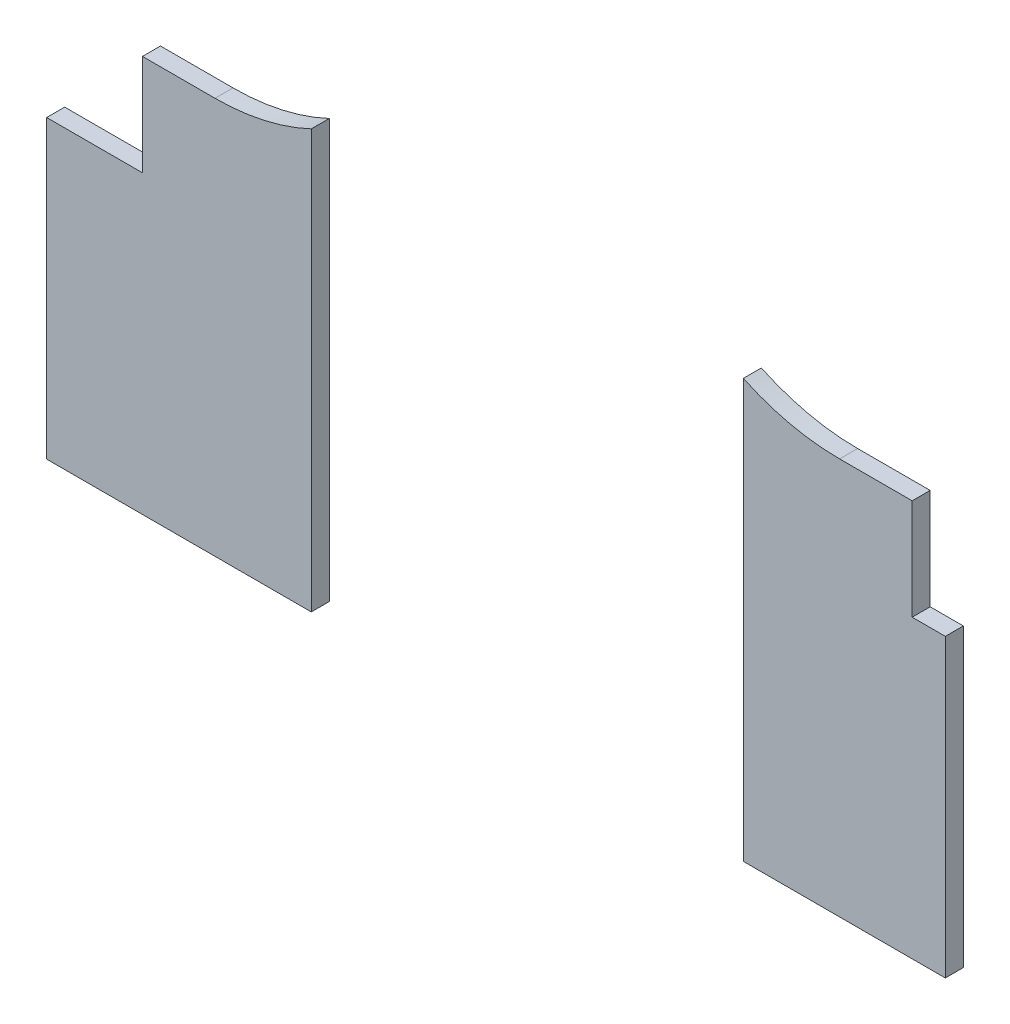
ISO-10303-21;
HEADER;
FILE_DESCRIPTION(('STEP AP214'),'2;1');
FILE_NAME('part.step','',(''),(''),'','','');
FILE_SCHEMA(('AUTOMOTIVE_DESIGN { 1 0 10303 214 1 1 1 1 }'));
ENDSEC;
DATA;
#1=APPLICATION_CONTEXT('core data for automotive mechanical design processes');
#2=APPLICATION_PROTOCOL_DEFINITION('international standard','automotive_design',2000,#1);
#3=PRODUCT_CONTEXT('',#1,'mechanical');
#4=PRODUCT('Part','Part','',(#3));
#5=PRODUCT_RELATED_PRODUCT_CATEGORY('part','',(#4));
#6=PRODUCT_DEFINITION_FORMATION('','',#4);
#7=PRODUCT_DEFINITION_CONTEXT('part definition',#1,'design');
#8=PRODUCT_DEFINITION('design','',#6,#7);
#9=PRODUCT_DEFINITION_SHAPE('','',#8);
#10=(LENGTH_UNIT() NAMED_UNIT(*) SI_UNIT(.MILLI.,.METRE.));
#11=(NAMED_UNIT(*) PLANE_ANGLE_UNIT() SI_UNIT($,.RADIAN.));
#12=(NAMED_UNIT(*) SI_UNIT($,.STERADIAN.) SOLID_ANGLE_UNIT());
#13=UNCERTAINTY_MEASURE_WITH_UNIT(LENGTH_MEASURE(1.E-05),#10,'distance_accuracy_value','');
#14=(GEOMETRIC_REPRESENTATION_CONTEXT(3) GLOBAL_UNCERTAINTY_ASSIGNED_CONTEXT((#13)) GLOBAL_UNIT_ASSIGNED_CONTEXT((#10,
#11,#12)) REPRESENTATION_CONTEXT('',''));
#15=CARTESIAN_POINT('',(0.,0.,0.));
#16=DIRECTION('',(0.,0.,1.));
#17=DIRECTION('',(1.,0.,0.));
#18=AXIS2_PLACEMENT_3D('',#15,#16,#17);
#19=CARTESIAN_POINT('',(0.,0.,5.));
#20=DIRECTION('',(0.,0.,1.));
#21=DIRECTION('',(1.,0.,0.));
#22=AXIS2_PLACEMENT_3D('',#19,#20,#21);
#23=PLANE('',#22);
#24=DIRECTION('',(0.,-1.,0.));
#25=VECTOR('',#24,1.);
#26=CARTESIAN_POINT('',(73.5,-195.561220372056,5.));
#27=LINE('',#26,#25);
#28=CARTESIAN_POINT('',(73.5,-79.3612478970206,5.));
#29=VERTEX_POINT('',#28);
#30=CARTESIAN_POINT('',(73.5,-195.561220372056,5.));
#31=VERTEX_POINT('',#30);
#32=EDGE_CURVE('E12',#29,#31,#27,.T.);
#33=ORIENTED_EDGE('',*,*,#32,.F.);
#34=CARTESIAN_POINT('',(46.7503925080926,-22.8748911457759,5.));
#35=DIRECTION('',(0.,0.,1.));
#36=DIRECTION('',(1.,0.,0.));
#37=AXIS2_PLACEMENT_3D('',#34,#35,#36);
#38=CIRCLE('',#37,62.5);
#39=CARTESIAN_POINT('',(46.7503925080926,-85.3748911457759,5.));
#40=VERTEX_POINT('',#39);
#41=EDGE_CURVE('E129',#40,#29,#38,.T.);
#42=ORIENTED_EDGE('',*,*,#41,.F.);
#43=DIRECTION('',(1.,0.,0.));
#44=VECTOR('',#43,1.);
#45=CARTESIAN_POINT('',(26.6043383580258,-85.3748911457759,5.));
#46=LINE('',#45,#44);
#47=CARTESIAN_POINT('',(26.6043383580258,-85.3748911457759,5.));
#48=VERTEX_POINT('',#47);
#49=EDGE_CURVE('E147',#48,#40,#46,.T.);
#50=ORIENTED_EDGE('',*,*,#49,.F.);
#51=DIRECTION('',(0.,1.,0.));
#52=VECTOR('',#51,1.);
#53=CARTESIAN_POINT('',(26.6043383580258,-113.374891145776,5.));
#54=LINE('',#53,#52);
#55=CARTESIAN_POINT('',(26.6043383580258,-113.374891145776,5.));
#56=VERTEX_POINT('',#55);
#57=EDGE_CURVE('E145',#56,#48,#54,.T.);
#58=ORIENTED_EDGE('',*,*,#57,.F.);
#59=DIRECTION('',(1.,0.,0.));
#60=VECTOR('',#59,1.);
#61=CARTESIAN_POINT('',(0.,-113.374891145776,5.));
#62=LINE('',#61,#60);
#63=CARTESIAN_POINT('',(0.,-113.374891145776,5.));
#64=VERTEX_POINT('',#63);
#65=EDGE_CURVE('E132',#64,#56,#62,.T.);
#66=ORIENTED_EDGE('',*,*,#65,.F.);
#67=DIRECTION('',(0.,-1.,0.));
#68=VECTOR('',#67,1.);
#69=CARTESIAN_POINT('',(0.,0.,5.));
#70=LINE('',#69,#68);
#71=CARTESIAN_POINT('',(0.,-195.561220372056,5.));
#72=VERTEX_POINT('',#71);
#73=EDGE_CURVE('E128',#64,#72,#70,.T.);
#74=ORIENTED_EDGE('',*,*,#73,.T.);
#75=DIRECTION('',(-1.,0.,0.));
#76=VECTOR('',#75,1.);
#77=CARTESIAN_POINT('',(0.,-195.561220372056,5.));
#78=LINE('',#77,#76);
#79=EDGE_CURVE('E50',#31,#72,#78,.T.);
#80=ORIENTED_EDGE('',*,*,#79,.F.);
#81=EDGE_LOOP('',(#33,#42,#50,#58,#66,#74,#80));
#82=FACE_BOUND('',#81,.T.);
#83=ADVANCED_FACE('F47',(#82),#23,.T.);
#84=CARTESIAN_POINT('',(0.,0.,0.));
#85=DIRECTION('',(0.,0.,1.));
#86=DIRECTION('',(1.,0.,0.));
#87=AXIS2_PLACEMENT_3D('',#84,#85,#86);
#88=PLANE('',#87);
#89=CARTESIAN_POINT('',(46.7503925080926,-22.8748911457759,0.));
#90=DIRECTION('',(0.,0.,1.));
#91=DIRECTION('',(1.,0.,0.));
#92=AXIS2_PLACEMENT_3D('',#89,#90,#91);
#93=CIRCLE('',#92,62.5);
#94=CARTESIAN_POINT('',(46.7503925080926,-85.3748911457759,0.));
#95=VERTEX_POINT('',#94);
#96=CARTESIAN_POINT('',(73.5,-79.3612478970206,0.));
#97=VERTEX_POINT('',#96);
#98=EDGE_CURVE('E133',#95,#97,#93,.T.);
#99=ORIENTED_EDGE('',*,*,#98,.T.);
#100=DIRECTION('',(0.,-1.,0.));
#101=VECTOR('',#100,1.);
#102=CARTESIAN_POINT('',(73.5,-195.561220372056,0.));
#103=LINE('',#102,#101);
#104=CARTESIAN_POINT('',(73.5,-195.561220372056,0.));
#105=VERTEX_POINT('',#104);
#106=EDGE_CURVE('E136',#97,#105,#103,.T.);
#107=ORIENTED_EDGE('',*,*,#106,.T.);
#108=DIRECTION('',(-1.,0.,0.));
#109=VECTOR('',#108,1.);
#110=CARTESIAN_POINT('',(0.,-195.561220372056,0.));
#111=LINE('',#110,#109);
#112=CARTESIAN_POINT('',(0.,-195.561220372056,0.));
#113=VERTEX_POINT('',#112);
#114=EDGE_CURVE('E112',#105,#113,#111,.T.);
#115=ORIENTED_EDGE('',*,*,#114,.T.);
#116=DIRECTION('',(0.,-1.,0.));
#117=VECTOR('',#116,1.);
#118=CARTESIAN_POINT('',(0.,0.,0.));
#119=LINE('',#118,#117);
#120=CARTESIAN_POINT('',(0.,-113.374891145776,0.));
#121=VERTEX_POINT('',#120);
#122=EDGE_CURVE('E124',#121,#113,#119,.T.);
#123=ORIENTED_EDGE('',*,*,#122,.F.);
#124=DIRECTION('',(1.,0.,0.));
#125=VECTOR('',#124,1.);
#126=CARTESIAN_POINT('',(0.,-113.374891145776,0.));
#127=LINE('',#126,#125);
#128=CARTESIAN_POINT('',(26.6043383580258,-113.374891145776,0.));
#129=VERTEX_POINT('',#128);
#130=EDGE_CURVE('E161',#121,#129,#127,.T.);
#131=ORIENTED_EDGE('',*,*,#130,.T.);
#132=DIRECTION('',(0.,1.,0.));
#133=VECTOR('',#132,1.);
#134=CARTESIAN_POINT('',(26.6043383580258,-113.374891145776,0.));
#135=LINE('',#134,#133);
#136=CARTESIAN_POINT('',(26.6043383580258,-85.3748911457759,0.));
#137=VERTEX_POINT('',#136);
#138=EDGE_CURVE('E158',#129,#137,#135,.T.);
#139=ORIENTED_EDGE('',*,*,#138,.T.);
#140=DIRECTION('',(1.,0.,0.));
#141=VECTOR('',#140,1.);
#142=CARTESIAN_POINT('',(26.6043383580258,-85.3748911457759,0.));
#143=LINE('',#142,#141);
#144=EDGE_CURVE('E155',#137,#95,#143,.T.);
#145=ORIENTED_EDGE('',*,*,#144,.T.);
#146=EDGE_LOOP('',(#99,#107,#115,#123,#131,#139,#145));
#147=FACE_BOUND('',#146,.T.);
#148=ADVANCED_FACE('F165',(#147),#88,.F.);
#149=CARTESIAN_POINT('',(0.,-195.561220372056,0.));
#150=DIRECTION('',(0.,1.,0.));
#151=DIRECTION('',(0.,0.,1.));
#152=AXIS2_PLACEMENT_3D('',#149,#150,#151);
#153=PLANE('',#152);
#154=ORIENTED_EDGE('',*,*,#114,.F.);
#155=DIRECTION('',(0.,0.,1.));
#156=VECTOR('',#155,1.);
#157=CARTESIAN_POINT('',(73.5,-195.561220372056,0.));
#158=LINE('',#157,#156);
#159=EDGE_CURVE('E121',#105,#31,#158,.T.);
#160=ORIENTED_EDGE('',*,*,#159,.T.);
#161=ORIENTED_EDGE('',*,*,#79,.T.);
#162=DIRECTION('',(0.,0.,1.));
#163=VECTOR('',#162,1.);
#164=CARTESIAN_POINT('',(0.,-195.561220372056,0.));
#165=LINE('',#164,#163);
#166=EDGE_CURVE('E119',#113,#72,#165,.T.);
#167=ORIENTED_EDGE('',*,*,#166,.F.);
#168=EDGE_LOOP('',(#154,#160,#161,#167));
#169=FACE_BOUND('',#168,.T.);
#170=ADVANCED_FACE('F118',(#169),#153,.F.);
#171=CARTESIAN_POINT('',(0.,0.,5.));
#172=DIRECTION('',(1.,0.,0.));
#173=DIRECTION('',(0.,1.,0.));
#174=AXIS2_PLACEMENT_3D('',#171,#172,#173);
#175=PLANE('',#174);
#176=ORIENTED_EDGE('',*,*,#73,.F.);
#177=DIRECTION('',(0.,0.,1.));
#178=VECTOR('',#177,1.);
#179=CARTESIAN_POINT('',(0.,-113.374891145776,0.));
#180=LINE('',#179,#178);
#181=EDGE_CURVE('E56',#121,#64,#180,.T.);
#182=ORIENTED_EDGE('',*,*,#181,.F.);
#183=ORIENTED_EDGE('',*,*,#122,.T.);
#184=ORIENTED_EDGE('',*,*,#166,.T.);
#185=EDGE_LOOP('',(#176,#182,#183,#184));
#186=FACE_BOUND('',#185,.T.);
#187=ADVANCED_FACE('F127',(#186),#175,.F.);
#188=CARTESIAN_POINT('',(46.7503925080926,-22.8748911457759,0.));
#189=DIRECTION('',(0.,0.,1.));
#190=DIRECTION('',(1.,0.,0.));
#191=AXIS2_PLACEMENT_3D('',#188,#189,#190);
#192=CYLINDRICAL_SURFACE('',#191,62.5);
#193=ORIENTED_EDGE('',*,*,#41,.T.);
#194=DIRECTION('',(0.,0.,1.));
#195=VECTOR('',#194,1.);
#196=CARTESIAN_POINT('',(73.5,-79.3612478970206,0.));
#197=LINE('',#196,#195);
#198=EDGE_CURVE('E64',#29,#97,#197,.F.);
#199=ORIENTED_EDGE('',*,*,#198,.T.);
#200=ORIENTED_EDGE('',*,*,#98,.F.);
#201=DIRECTION('',(0.,0.,1.));
#202=VECTOR('',#201,1.);
#203=CARTESIAN_POINT('',(46.7503925080926,-85.3748911457759,0.));
#204=LINE('',#203,#202);
#205=EDGE_CURVE('E148',#95,#40,#204,.T.);
#206=ORIENTED_EDGE('',*,*,#205,.T.);
#207=EDGE_LOOP('',(#193,#199,#200,#206));
#208=FACE_BOUND('',#207,.T.);
#209=ADVANCED_FACE('F169',(#208),#192,.F.);
#210=CARTESIAN_POINT('',(26.6043383580258,-85.3748911457759,0.));
#211=DIRECTION('',(0.,-1.,0.));
#212=DIRECTION('',(1.,0.,0.));
#213=AXIS2_PLACEMENT_3D('',#210,#211,#212);
#214=PLANE('',#213);
#215=ORIENTED_EDGE('',*,*,#49,.T.);
#216=ORIENTED_EDGE('',*,*,#205,.F.);
#217=ORIENTED_EDGE('',*,*,#144,.F.);
#218=DIRECTION('',(0.,0.,1.));
#219=VECTOR('',#218,1.);
#220=CARTESIAN_POINT('',(26.6043383580258,-85.3748911457759,0.));
#221=LINE('',#220,#219);
#222=EDGE_CURVE('E98',#137,#48,#221,.T.);
#223=ORIENTED_EDGE('',*,*,#222,.T.);
#224=EDGE_LOOP('',(#215,#216,#217,#223));
#225=FACE_BOUND('',#224,.T.);
#226=ADVANCED_FACE('F172',(#225),#214,.F.);
#227=CARTESIAN_POINT('',(26.6043383580258,-113.374891145776,0.));
#228=DIRECTION('',(1.,0.,0.));
#229=DIRECTION('',(0.,0.,-1.));
#230=AXIS2_PLACEMENT_3D('',#227,#228,#229);
#231=PLANE('',#230);
#232=ORIENTED_EDGE('',*,*,#57,.T.);
#233=ORIENTED_EDGE('',*,*,#222,.F.);
#234=ORIENTED_EDGE('',*,*,#138,.F.);
#235=DIRECTION('',(0.,0.,1.));
#236=VECTOR('',#235,1.);
#237=CARTESIAN_POINT('',(26.6043383580258,-113.374891145776,0.));
#238=LINE('',#237,#236);
#239=EDGE_CURVE('E142',#129,#56,#238,.T.);
#240=ORIENTED_EDGE('',*,*,#239,.T.);
#241=EDGE_LOOP('',(#232,#233,#234,#240));
#242=FACE_BOUND('',#241,.T.);
#243=ADVANCED_FACE('F174',(#242),#231,.F.);
#244=CARTESIAN_POINT('',(0.,-113.374891145776,0.));
#245=DIRECTION('',(0.,-1.,0.));
#246=DIRECTION('',(0.,0.,-1.));
#247=AXIS2_PLACEMENT_3D('',#244,#245,#246);
#248=PLANE('',#247);
#249=ORIENTED_EDGE('',*,*,#65,.T.);
#250=ORIENTED_EDGE('',*,*,#239,.F.);
#251=ORIENTED_EDGE('',*,*,#130,.F.);
#252=ORIENTED_EDGE('',*,*,#181,.T.);
#253=EDGE_LOOP('',(#249,#250,#251,#252));
#254=FACE_BOUND('',#253,.T.);
#255=ADVANCED_FACE('F175',(#254),#248,.F.);
#256=CARTESIAN_POINT('',(73.5,-195.561220372056,0.));
#257=DIRECTION('',(-1.,0.,0.));
#258=DIRECTION('',(0.,-1.,0.));
#259=AXIS2_PLACEMENT_3D('',#256,#257,#258);
#260=PLANE('',#259);
#261=ORIENTED_EDGE('',*,*,#32,.T.);
#262=ORIENTED_EDGE('',*,*,#159,.F.);
#263=ORIENTED_EDGE('',*,*,#106,.F.);
#264=ORIENTED_EDGE('',*,*,#198,.F.);
#265=EDGE_LOOP('',(#261,#262,#263,#264));
#266=FACE_BOUND('',#265,.T.);
#267=ADVANCED_FACE('F167',(#266),#260,.F.);
#268=CLOSED_SHELL('',(#83,#148,#170,#187,#209,#226,#243,#255,#267));
#269=MANIFOLD_SOLID_BREP('B2',#268);
#270=CARTESIAN_POINT('',(249.6,-113.374891145776,0.));
#271=DIRECTION('',(0.,-1.,0.));
#272=DIRECTION('',(0.,0.,-1.));
#273=AXIS2_PLACEMENT_3D('',#270,#271,#272);
#274=PLANE('',#273);
#275=DIRECTION('',(1.,0.,0.));
#276=VECTOR('',#275,1.);
#277=CARTESIAN_POINT('',(249.6,-113.374891145776,5.));
#278=LINE('',#277,#276);
#279=CARTESIAN_POINT('',(240.395661641974,-113.374891145776,5.));
#280=VERTEX_POINT('',#279);
#281=CARTESIAN_POINT('',(249.6,-113.374891145776,5.));
#282=VERTEX_POINT('',#281);
#283=EDGE_CURVE('E336',#280,#282,#278,.T.);
#284=ORIENTED_EDGE('',*,*,#283,.T.);
#285=DIRECTION('',(0.,0.,1.));
#286=VECTOR('',#285,1.);
#287=CARTESIAN_POINT('',(249.6,-113.374891145776,0.));
#288=LINE('',#287,#286);
#289=CARTESIAN_POINT('',(249.6,-113.374891145776,0.));
#290=VERTEX_POINT('',#289);
#291=EDGE_CURVE('E352',#290,#282,#288,.T.);
#292=ORIENTED_EDGE('',*,*,#291,.F.);
#293=DIRECTION('',(1.,0.,0.));
#294=VECTOR('',#293,1.);
#295=CARTESIAN_POINT('',(249.6,-113.374891145776,0.));
#296=LINE('',#295,#294);
#297=CARTESIAN_POINT('',(240.395661641974,-113.374891145776,0.));
#298=VERTEX_POINT('',#297);
#299=EDGE_CURVE('E340',#298,#290,#296,.T.);
#300=ORIENTED_EDGE('',*,*,#299,.F.);
#301=DIRECTION('',(0.,0.,1.));
#302=VECTOR('',#301,1.);
#303=CARTESIAN_POINT('',(240.395661641974,-113.374891145776,0.));
#304=LINE('',#303,#302);
#305=EDGE_CURVE('E355',#298,#280,#304,.T.);
#306=ORIENTED_EDGE('',*,*,#305,.T.);
#307=EDGE_LOOP('',(#284,#292,#300,#306));
#308=FACE_BOUND('',#307,.T.);
#309=ADVANCED_FACE('F249',(#308),#274,.F.);
#310=CARTESIAN_POINT('',(240.395661641974,-113.374891145776,0.));
#311=DIRECTION('',(-1.,0.,0.));
#312=DIRECTION('',(0.,0.,1.));
#313=AXIS2_PLACEMENT_3D('',#310,#311,#312);
#314=PLANE('',#313);
#315=DIRECTION('',(0.,-1.,0.));
#316=VECTOR('',#315,1.);
#317=CARTESIAN_POINT('',(240.395661641974,-113.374891145776,5.));
#318=LINE('',#317,#316);
#319=CARTESIAN_POINT('',(240.395661641974,-85.3748911457758,5.));
#320=VERTEX_POINT('',#319);
#321=EDGE_CURVE('E348',#320,#280,#318,.T.);
#322=ORIENTED_EDGE('',*,*,#321,.T.);
#323=ORIENTED_EDGE('',*,*,#305,.F.);
#324=DIRECTION('',(0.,-1.,0.));
#325=VECTOR('',#324,1.);
#326=CARTESIAN_POINT('',(240.395661641974,-113.374891145776,0.));
#327=LINE('',#326,#325);
#328=CARTESIAN_POINT('',(240.395661641974,-85.3748911457758,0.));
#329=VERTEX_POINT('',#328);
#330=EDGE_CURVE('E272',#329,#298,#327,.T.);
#331=ORIENTED_EDGE('',*,*,#330,.F.);
#332=DIRECTION('',(0.,0.,1.));
#333=VECTOR('',#332,1.);
#334=CARTESIAN_POINT('',(240.395661641974,-85.3748911457758,0.));
#335=LINE('',#334,#333);
#336=EDGE_CURVE('E357',#329,#320,#335,.T.);
#337=ORIENTED_EDGE('',*,*,#336,.T.);
#338=EDGE_LOOP('',(#322,#323,#331,#337));
#339=FACE_BOUND('',#338,.T.);
#340=ADVANCED_FACE('F368',(#339),#314,.F.);
#341=CARTESIAN_POINT('',(240.395661641974,-85.3748911457758,0.));
#342=DIRECTION('',(0.,-1.,0.));
#343=DIRECTION('',(0.,0.,-1.));
#344=AXIS2_PLACEMENT_3D('',#341,#342,#343);
#345=PLANE('',#344);
#346=DIRECTION('',(1.,0.,0.));
#347=VECTOR('',#346,1.);
#348=CARTESIAN_POINT('',(240.395661641974,-85.3748911457758,5.));
#349=LINE('',#348,#347);
#350=CARTESIAN_POINT('',(220.249607491907,-85.3748911457758,5.));
#351=VERTEX_POINT('',#350);
#352=EDGE_CURVE('E345',#351,#320,#349,.T.);
#353=ORIENTED_EDGE('',*,*,#352,.T.);
#354=ORIENTED_EDGE('',*,*,#336,.F.);
#355=DIRECTION('',(1.,0.,0.));
#356=VECTOR('',#355,1.);
#357=CARTESIAN_POINT('',(240.395661641974,-85.3748911457758,0.));
#358=LINE('',#357,#356);
#359=CARTESIAN_POINT('',(220.249607491907,-85.3748911457758,0.));
#360=VERTEX_POINT('',#359);
#361=EDGE_CURVE('E335',#360,#329,#358,.T.);
#362=ORIENTED_EDGE('',*,*,#361,.F.);
#363=DIRECTION('',(0.,0.,1.));
#364=VECTOR('',#363,1.);
#365=CARTESIAN_POINT('',(220.249607491907,-85.3748911457758,0.));
#366=LINE('',#365,#364);
#367=EDGE_CURVE('E343',#360,#351,#366,.T.);
#368=ORIENTED_EDGE('',*,*,#367,.T.);
#369=EDGE_LOOP('',(#353,#354,#362,#368));
#370=FACE_BOUND('',#369,.T.);
#371=ADVANCED_FACE('F363',(#370),#345,.F.);
#372=CARTESIAN_POINT('',(249.6,0.,5.));
#373=DIRECTION('',(-1.,0.,0.));
#374=DIRECTION('',(0.,-1.,0.));
#375=AXIS2_PLACEMENT_3D('',#372,#373,#374);
#376=PLANE('',#375);
#377=DIRECTION('',(0.,1.,0.));
#378=VECTOR('',#377,1.);
#379=CARTESIAN_POINT('',(249.6,0.,5.));
#380=LINE('',#379,#378);
#381=CARTESIAN_POINT('',(249.6,-195.561220372056,5.));
#382=VERTEX_POINT('',#381);
#383=EDGE_CURVE('E45',#382,#282,#380,.T.);
#384=ORIENTED_EDGE('',*,*,#383,.F.);
#385=DIRECTION('',(0.,0.,1.));
#386=VECTOR('',#385,1.);
#387=CARTESIAN_POINT('',(249.6,-195.561220372056,0.));
#388=LINE('',#387,#386);
#389=CARTESIAN_POINT('',(249.6,-195.561220372056,0.));
#390=VERTEX_POINT('',#389);
#391=EDGE_CURVE('E326',#390,#382,#388,.T.);
#392=ORIENTED_EDGE('',*,*,#391,.F.);
#393=DIRECTION('',(0.,1.,0.));
#394=VECTOR('',#393,1.);
#395=CARTESIAN_POINT('',(249.6,0.,0.));
#396=LINE('',#395,#394);
#397=EDGE_CURVE('E253',#390,#290,#396,.T.);
#398=ORIENTED_EDGE('',*,*,#397,.T.);
#399=ORIENTED_EDGE('',*,*,#291,.T.);
#400=EDGE_LOOP('',(#384,#392,#398,#399));
#401=FACE_BOUND('',#400,.T.);
#402=ADVANCED_FACE('F251',(#401),#376,.F.);
#403=CARTESIAN_POINT('',(220.249607491907,-22.8748911457758,0.));
#404=DIRECTION('',(0.,0.,1.));
#405=DIRECTION('',(1.,0.,0.));
#406=AXIS2_PLACEMENT_3D('',#403,#404,#405);
#407=CYLINDRICAL_SURFACE('',#406,62.5);
#408=CARTESIAN_POINT('',(220.249607491907,-22.8748911457758,0.));
#409=DIRECTION('',(0.,0.,1.));
#410=DIRECTION('',(-1.,0.,0.));
#411=AXIS2_PLACEMENT_3D('',#408,#409,#410);
#412=CIRCLE('',#411,62.5);
#413=CARTESIAN_POINT('',(193.5,-79.3612478970205,0.));
#414=VERTEX_POINT('',#413);
#415=EDGE_CURVE('E333',#414,#360,#412,.T.);
#416=ORIENTED_EDGE('',*,*,#415,.F.);
#417=DIRECTION('',(0.,0.,1.));
#418=VECTOR('',#417,1.);
#419=CARTESIAN_POINT('',(193.5,-79.3612478970205,0.));
#420=LINE('',#419,#418);
#421=CARTESIAN_POINT('',(193.5,-79.3612478970205,5.));
#422=VERTEX_POINT('',#421);
#423=EDGE_CURVE('E313',#414,#422,#420,.T.);
#424=ORIENTED_EDGE('',*,*,#423,.T.);
#425=CARTESIAN_POINT('',(220.249607491907,-22.8748911457758,5.));
#426=DIRECTION('',(0.,0.,1.));
#427=DIRECTION('',(-1.,0.,0.));
#428=AXIS2_PLACEMENT_3D('',#425,#426,#427);
#429=CIRCLE('',#428,62.5);
#430=EDGE_CURVE('E322',#422,#351,#429,.T.);
#431=ORIENTED_EDGE('',*,*,#430,.T.);
#432=ORIENTED_EDGE('',*,*,#367,.F.);
#433=EDGE_LOOP('',(#416,#424,#431,#432));
#434=FACE_BOUND('',#433,.T.);
#435=ADVANCED_FACE('F372',(#434),#407,.F.);
#436=CARTESIAN_POINT('',(0.,-195.561220372056,0.));
#437=DIRECTION('',(0.,1.,0.));
#438=DIRECTION('',(0.,0.,1.));
#439=AXIS2_PLACEMENT_3D('',#436,#437,#438);
#440=PLANE('',#439);
#441=DIRECTION('',(-1.,0.,0.));
#442=VECTOR('',#441,1.);
#443=CARTESIAN_POINT('',(0.,-195.561220372056,5.));
#444=LINE('',#443,#442);
#445=CARTESIAN_POINT('',(193.5,-195.561220372056,5.));
#446=VERTEX_POINT('',#445);
#447=EDGE_CURVE('E319',#382,#446,#444,.T.);
#448=ORIENTED_EDGE('',*,*,#447,.T.);
#449=DIRECTION('',(0.,0.,1.));
#450=VECTOR('',#449,1.);
#451=CARTESIAN_POINT('',(193.5,-195.561220372056,0.));
#452=LINE('',#451,#450);
#453=CARTESIAN_POINT('',(193.5,-195.561220372056,0.));
#454=VERTEX_POINT('',#453);
#455=EDGE_CURVE('E305',#454,#446,#452,.T.);
#456=ORIENTED_EDGE('',*,*,#455,.F.);
#457=DIRECTION('',(-1.,0.,0.));
#458=VECTOR('',#457,1.);
#459=CARTESIAN_POINT('',(0.,-195.561220372056,0.));
#460=LINE('',#459,#458);
#461=EDGE_CURVE('E327',#390,#454,#460,.T.);
#462=ORIENTED_EDGE('',*,*,#461,.F.);
#463=ORIENTED_EDGE('',*,*,#391,.T.);
#464=EDGE_LOOP('',(#448,#456,#462,#463));
#465=FACE_BOUND('',#464,.T.);
#466=ADVANCED_FACE('F324',(#465),#440,.F.);
#467=CARTESIAN_POINT('',(0.,0.,0.));
#468=DIRECTION('',(0.,0.,1.));
#469=DIRECTION('',(1.,0.,0.));
#470=AXIS2_PLACEMENT_3D('',#467,#468,#469);
#471=PLANE('',#470);
#472=ORIENTED_EDGE('',*,*,#461,.T.);
#473=DIRECTION('',(0.,1.,0.));
#474=VECTOR('',#473,1.);
#475=CARTESIAN_POINT('',(193.5,-195.561220372056,0.));
#476=LINE('',#475,#474);
#477=EDGE_CURVE('E264',#454,#414,#476,.T.);
#478=ORIENTED_EDGE('',*,*,#477,.T.);
#479=ORIENTED_EDGE('',*,*,#415,.T.);
#480=ORIENTED_EDGE('',*,*,#361,.T.);
#481=ORIENTED_EDGE('',*,*,#330,.T.);
#482=ORIENTED_EDGE('',*,*,#299,.T.);
#483=ORIENTED_EDGE('',*,*,#397,.F.);
#484=EDGE_LOOP('',(#472,#478,#479,#480,#481,#482,#483));
#485=FACE_BOUND('',#484,.T.);
#486=ADVANCED_FACE('F371',(#485),#471,.F.);
#487=CARTESIAN_POINT('',(0.,0.,5.));
#488=DIRECTION('',(0.,0.,1.));
#489=DIRECTION('',(1.,0.,0.));
#490=AXIS2_PLACEMENT_3D('',#487,#488,#489);
#491=PLANE('',#490);
#492=DIRECTION('',(0.,1.,0.));
#493=VECTOR('',#492,1.);
#494=CARTESIAN_POINT('',(193.5,-195.561220372056,5.));
#495=LINE('',#494,#493);
#496=EDGE_CURVE('E308',#446,#422,#495,.T.);
#497=ORIENTED_EDGE('',*,*,#496,.F.);
#498=ORIENTED_EDGE('',*,*,#447,.F.);
#499=ORIENTED_EDGE('',*,*,#383,.T.);
#500=ORIENTED_EDGE('',*,*,#283,.F.);
#501=ORIENTED_EDGE('',*,*,#321,.F.);
#502=ORIENTED_EDGE('',*,*,#352,.F.);
#503=ORIENTED_EDGE('',*,*,#430,.F.);
#504=EDGE_LOOP('',(#497,#498,#499,#500,#501,#502,#503));
#505=FACE_BOUND('',#504,.T.);
#506=ADVANCED_FACE('F318',(#505),#491,.T.);
#507=CARTESIAN_POINT('',(193.5,-195.561220372056,0.));
#508=DIRECTION('',(1.,0.,0.));
#509=DIRECTION('',(0.,1.,0.));
#510=AXIS2_PLACEMENT_3D('',#507,#508,#509);
#511=PLANE('',#510);
#512=ORIENTED_EDGE('',*,*,#477,.F.);
#513=ORIENTED_EDGE('',*,*,#455,.T.);
#514=ORIENTED_EDGE('',*,*,#496,.T.);
#515=ORIENTED_EDGE('',*,*,#423,.F.);
#516=EDGE_LOOP('',(#512,#513,#514,#515));
#517=FACE_BOUND('',#516,.T.);
#518=ADVANCED_FACE('F307',(#517),#511,.F.);
#519=CLOSED_SHELL('',(#309,#340,#371,#402,#435,#466,#486,#506,#518));
#520=MANIFOLD_SOLID_BREP('B6',#519);
#521=ADVANCED_BREP_SHAPE_REPRESENTATION('',(#18,#269,#520),#14);
#522=SHAPE_DEFINITION_REPRESENTATION(#9,#521);
ENDSEC;
END-ISO-10303-21;
